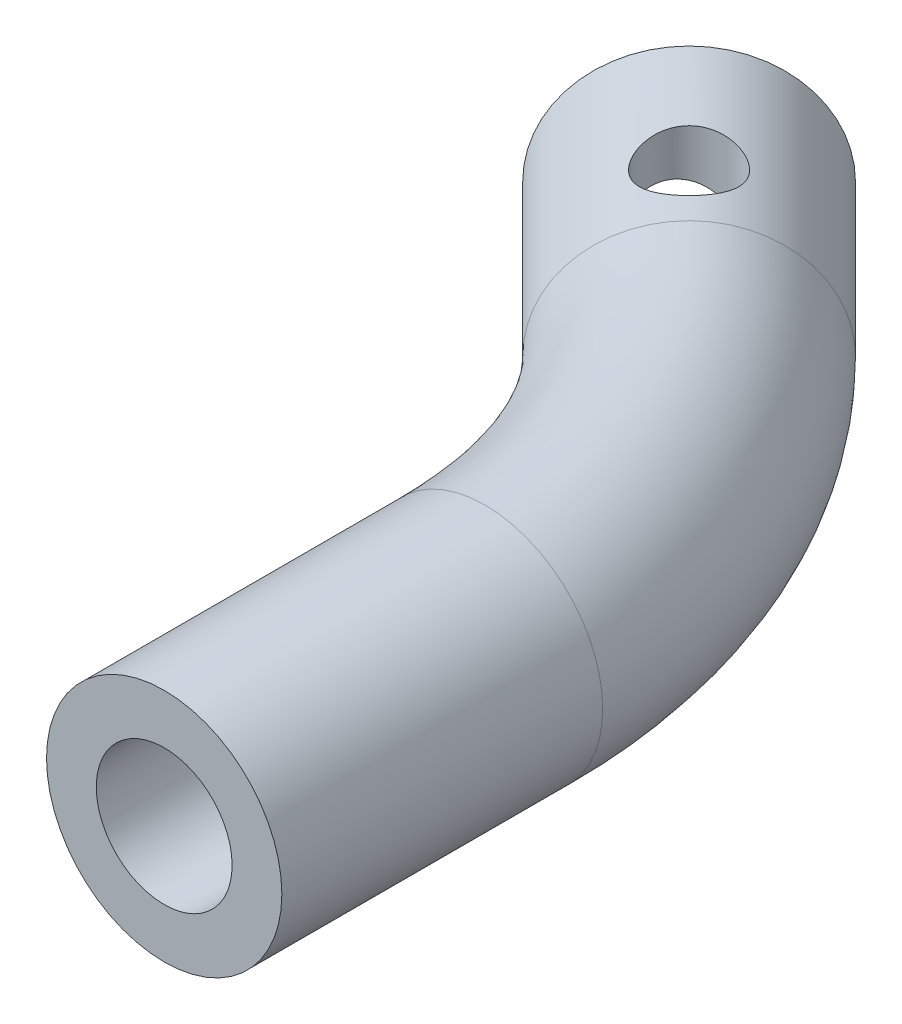
ISO-10303-21;
HEADER;
FILE_DESCRIPTION(('STEP AP214'),'2;1');
FILE_NAME('part.step','',(''),(''),'','','');
FILE_SCHEMA(('AUTOMOTIVE_DESIGN { 1 0 10303 214 1 1 1 1 }'));
ENDSEC;
DATA;
#1=APPLICATION_CONTEXT('core data for automotive mechanical design processes');
#2=APPLICATION_PROTOCOL_DEFINITION('international standard','automotive_design',2000,#1);
#3=PRODUCT_CONTEXT('',#1,'mechanical');
#4=PRODUCT('Part','Part','',(#3));
#5=PRODUCT_RELATED_PRODUCT_CATEGORY('part','',(#4));
#6=PRODUCT_DEFINITION_FORMATION('','',#4);
#7=PRODUCT_DEFINITION_CONTEXT('part definition',#1,'design');
#8=PRODUCT_DEFINITION('design','',#6,#7);
#9=PRODUCT_DEFINITION_SHAPE('','',#8);
#10=(LENGTH_UNIT() NAMED_UNIT(*) SI_UNIT(.MILLI.,.METRE.));
#11=(NAMED_UNIT(*) PLANE_ANGLE_UNIT() SI_UNIT($,.RADIAN.));
#12=(NAMED_UNIT(*) SI_UNIT($,.STERADIAN.) SOLID_ANGLE_UNIT());
#13=UNCERTAINTY_MEASURE_WITH_UNIT(LENGTH_MEASURE(1.E-05),#10,'distance_accuracy_value','');
#14=(GEOMETRIC_REPRESENTATION_CONTEXT(3) GLOBAL_UNCERTAINTY_ASSIGNED_CONTEXT((#13)) GLOBAL_UNIT_ASSIGNED_CONTEXT((#10,
#11,#12)) REPRESENTATION_CONTEXT('',''));
#15=CARTESIAN_POINT('',(0.,0.,0.));
#16=DIRECTION('',(0.,0.,1.));
#17=DIRECTION('',(1.,0.,0.));
#18=AXIS2_PLACEMENT_3D('',#15,#16,#17);
#19=CARTESIAN_POINT('',(-4.85514851334801,0.,-5.66753789451842));
#20=DIRECTION('',(-0.707106781186546,0.,-0.707106781186549));
#21=DIRECTION('',(-0.707106781186549,0.,0.707106781186546));
#22=AXIS2_PLACEMENT_3D('',#19,#20,#21);
#23=CYLINDRICAL_SURFACE('',#22,3.4);
#24=CARTESIAN_POINT('',(-11.9262163252135,0.,-12.7386057063839));
#25=DIRECTION('',(-0.707106781186546,0.,-0.707106781186549));
#26=DIRECTION('',(-0.707106781186549,0.,0.707106781186546));
#27=AXIS2_PLACEMENT_3D('',#24,#25,#26);
#28=CIRCLE('',#27,3.4);
#29=CARTESIAN_POINT('',(-14.3303793812477,0.,-10.3344426503497));
#30=VERTEX_POINT('',#29);
#31=EDGE_CURVE('E117',#30,#30,#28,.T.);
#32=ORIENTED_EDGE('',*,*,#31,.T.);
#33=EDGE_LOOP('',(#32));
#34=FACE_BOUND('',#33,.T.);
#35=DIRECTION('',(0.707106781186546,0.,0.707106781186549));
#36=VECTOR('',#35,1.);
#37=CARTESIAN_POINT('',(-4.99577531487929,3.14119041053837,-7.64823143654679));
#38=LINE('',#37,#36);
#39=CARTESIAN_POINT('',(-4.98523735315701,3.14119041053837,-7.63769347482451));
#40=VERTEX_POINT('',#39);
#41=CARTESIAN_POINT('',(-3.93511514309947,3.14119041053837,-6.58757126476696));
#42=VERTEX_POINT('',#41);
#43=EDGE_CURVE('E104',#40,#42,#38,.T.);
#44=ORIENTED_EDGE('',*,*,#43,.F.);
#45=CARTESIAN_POINT('',(-6.67356115657351,2.52253271517302,-10.7098701089745));
#46=CARTESIAN_POINT('',(-6.55526154963019,2.44691776482946,-10.709878421822));
#47=CARTESIAN_POINT('',(-6.43728565245653,2.37057966917331,-10.6994407447605));
#48=CARTESIAN_POINT('',(-6.26137811729352,2.25917821019611,-10.6678394111869));
#49=CARTESIAN_POINT('',(-6.20289948816892,2.2225506046758,-10.6546412790773));
#50=CARTESIAN_POINT('',(-6.08626923692473,2.15129800425115,-10.6226544093641));
#51=CARTESIAN_POINT('',(-6.02811742024183,2.11667167050862,-10.6038694622425));
#52=CARTESIAN_POINT('',(-5.90390378104353,2.04596608387551,-10.557203139409));
#53=CARTESIAN_POINT('',(-5.83789477035139,2.01038208762843,-10.5284073454198));
#54=CARTESIAN_POINT('',(-5.70680360416759,1.94622863375601,-10.4622246414599));
#55=CARTESIAN_POINT('',(-5.6417197958534,1.91764462865681,-10.424855866661));
#56=CARTESIAN_POINT('',(-5.52576134745873,1.8754986042017,-10.348893712856));
#57=CARTESIAN_POINT('',(-5.47453491323624,1.86011491507725,-10.3118797074926));
#58=CARTESIAN_POINT('',(-5.37475052743602,1.83830517020546,-10.2320901761024));
#59=CARTESIAN_POINT('',(-5.32618860246142,1.83186540791627,-10.1893235764904));
#60=CARTESIAN_POINT('',(-5.233166621319,1.82896003386553,-10.098927523642));
#61=CARTESIAN_POINT('',(-5.18872033187191,1.83252673084298,-10.0512827980984));
#62=CARTESIAN_POINT('',(-5.10538932951066,1.84909881521793,-9.9528555681239));
#63=CARTESIAN_POINT('',(-5.06651229267916,1.8621170826315,-9.90206886848894));
#64=CARTESIAN_POINT('',(-4.98293917862994,1.90135470035835,-9.78169552488008));
#65=CARTESIAN_POINT('',(-4.94059573583293,1.93052174184468,-9.71146474489963));
#66=CARTESIAN_POINT('',(-4.86606768396412,1.99763318404686,-9.56976709457376));
#67=CARTESIAN_POINT('',(-4.83391523316302,2.03560472786079,-9.49829704741538));
#68=CARTESIAN_POINT('',(-4.78412601513678,2.10891552726148,-9.36856963929637));
#69=CARTESIAN_POINT('',(-4.76488849994516,2.14336583734099,-9.31040364265767));
#70=CARTESIAN_POINT('',(-4.73203058098702,2.21435517669441,-9.19374197593372));
#71=CARTESIAN_POINT('',(-4.71841349566797,2.25089542546895,-9.13524613169725));
#72=CARTESIAN_POINT('',(-4.685565208046,2.36219050399284,-8.95919084490964));
#73=CARTESIAN_POINT('',(-4.67435248746648,2.43859464053477,-8.84110522568608));
#74=CARTESIAN_POINT('',(-4.67281810718242,2.59350069938162,-8.59892663826993));
#75=CARTESIAN_POINT('',(-4.68342595714279,2.67194939713078,-8.47479570651102));
#76=CARTESIAN_POINT('',(-4.7286003132437,2.82279933517461,-8.22729601308951));
#77=CARTESIAN_POINT('',(-4.76311864179805,2.8952124086235,-8.10392622120957));
#78=CARTESIAN_POINT('',(-4.84707626251959,3.01432591807542,-7.88884258974138));
#79=CARTESIAN_POINT('',(-4.89136250308966,3.06313471249311,-7.79628987564021));
#80=CARTESIAN_POINT('',(-4.99584958509249,3.15241208310844,-7.61620813950764));
#81=CARTESIAN_POINT('',(-5.05604116112898,3.19288549060535,-7.52867622870202));
#82=CARTESIAN_POINT('',(-5.19259437972342,3.26389260075955,-7.36136437650046));
#83=CARTESIAN_POINT('',(-5.26906827204316,3.29435336400565,-7.28164416657274));
#84=CARTESIAN_POINT('',(-5.43630803642037,3.3437323538685,-7.13456844564721));
#85=CARTESIAN_POINT('',(-5.52706507683809,3.36265767813901,-7.06720534930099));
#86=CARTESIAN_POINT('',(-5.70856362321691,3.38752886943995,-6.95521768576628));
#87=CARTESIAN_POINT('',(-5.79807188339817,3.39473131221924,-6.90885725840143));
#88=CARTESIAN_POINT('',(-5.98327676990398,3.40119546242199,-6.83007423780456));
#89=CARTESIAN_POINT('',(-6.07897353911308,3.40045698643496,-6.79765196651853));
#90=CARTESIAN_POINT('',(-6.27322389189978,3.39269343902147,-6.74779801907405));
#91=CARTESIAN_POINT('',(-6.37175430857739,3.3857101102259,-6.73026831097975));
#92=CARTESIAN_POINT('',(-6.56993383685082,3.36750538454942,-6.71007206006545));
#93=CARTESIAN_POINT('',(-6.66958333036493,3.35628249533798,-6.70741075615664));
#94=CARTESIAN_POINT('',(-6.87652232811577,3.33067693816152,-6.71727259768482));
#95=CARTESIAN_POINT('',(-6.98372545229111,3.31610471454564,-6.73113177639953));
#96=CARTESIAN_POINT('',(-7.19457387639125,3.2872374318287,-6.77591821952636));
#97=CARTESIAN_POINT('',(-7.29821784197097,3.27294247753264,-6.80685181258715));
#98=CARTESIAN_POINT('',(-7.50464426668039,3.24654497745026,-6.88718700831109));
#99=CARTESIAN_POINT('',(-7.60711374688189,3.23459125453998,-6.93744930312979));
#100=CARTESIAN_POINT('',(-7.80234862909014,3.21626606639913,-7.0549372012131));
#101=CARTESIAN_POINT('',(-7.89511896679481,3.20989174962622,-7.12215411659592));
#102=CARTESIAN_POINT('',(-8.06418119376158,3.20418594255973,-7.26830376511213));
#103=CARTESIAN_POINT('',(-8.1410148074268,3.20455979857615,-7.34659871439432));
#104=CARTESIAN_POINT('',(-8.28074861315569,3.21155389818353,-7.51451256201124));
#105=CARTESIAN_POINT('',(-8.34364853277737,3.21817426389762,-7.6041316817108));
#106=CARTESIAN_POINT('',(-8.45253119354884,3.23616335830246,-7.7897731119036));
#107=CARTESIAN_POINT('',(-8.49887886508365,3.24741607786346,-7.88559384533096));
#108=CARTESIAN_POINT('',(-8.57575370310433,3.27266575094598,-8.08305460996796));
#109=CARTESIAN_POINT('',(-8.60627520297237,3.2866636849324,-8.18469671109436));
#110=CARTESIAN_POINT('',(-8.65206867969975,3.31573328954871,-8.39696418026023));
#111=CARTESIAN_POINT('',(-8.66644911529756,3.33082260144181,-8.50778038138248));
#112=CARTESIAN_POINT('',(-8.67656090833608,3.3583194135932,-8.73062753198165));
#113=CARTESIAN_POINT('',(-8.67229033312946,3.37072663578931,-8.84265860614576));
#114=CARTESIAN_POINT('',(-8.64488118854604,3.38988012575587,-9.06566083328911));
#115=CARTESIAN_POINT('',(-8.62162502135966,3.39659057746631,-9.17662100650523));
#116=CARTESIAN_POINT('',(-8.55660749684578,3.40140927452412,-9.39316035792195));
#117=CARTESIAN_POINT('',(-8.51486187252923,3.3995248207822,-9.49874402610273));
#118=CARTESIAN_POINT('',(-8.41877627601934,3.38575829448733,-9.69215252969889));
#119=CARTESIAN_POINT('',(-8.36581208056794,3.37474154399631,-9.78072398505206));
#120=CARTESIAN_POINT('',(-8.24790117007648,3.34316415190473,-9.94756202031571));
#121=CARTESIAN_POINT('',(-8.18295740850578,3.32260586080727,-10.0258311320568));
#122=CARTESIAN_POINT('',(-8.0470488589896,3.2733949613266,-10.166813728161));
#123=CARTESIAN_POINT('',(-7.97649998920151,3.24515946590663,-10.2300782175125));
#124=CARTESIAN_POINT('',(-7.82942752278879,3.18114582769358,-10.3447019371026));
#125=CARTESIAN_POINT('',(-7.75290140269784,3.14536448825207,-10.396056102345));
#126=CARTESIAN_POINT('',(-7.5893166398891,3.06415400080565,-10.4906214954634));
#127=CARTESIAN_POINT('',(-7.50191839635204,3.01815950337371,-10.5327512694249));
#128=CARTESIAN_POINT('',(-7.32486023073054,2.92052549705724,-10.6032528245899));
#129=CARTESIAN_POINT('',(-7.23520051361889,2.86888649836815,-10.631625847981));
#130=CARTESIAN_POINT('',(-7.06679710090465,2.76869059798469,-10.6724878540904));
#131=CARTESIAN_POINT('',(-6.98814799465012,2.72060440631464,-10.6865611741937));
#132=CARTESIAN_POINT('',(-6.83080539202486,2.62263030600994,-10.7052534957285));
#133=CARTESIAN_POINT('',(-6.7521119134588,2.57274092579012,-10.7098645892566));
#134=CARTESIAN_POINT('',(-6.67356115657351,2.52253271517302,-10.7098701089745));
#135=B_SPLINE_CURVE_WITH_KNOTS('',3,(#45,#46,#47,#48,#49,#50,#51,#52,#53,#54,#55,#56,#57,#58,
#59,#60,#61,#62,#63,#64,#65,#66,#67,#68,#69,#70,#71,#72,#73,#74,#75,#76,#77,#78,#79,#80,#81,#82,
#83,#84,#85,#86,#87,#88,#89,#90,#91,#92,#93,#94,#95,#96,#97,#98,#99,#100,#101,#102,#103,#104,
#105,#106,#107,#108,#109,#110,#111,#112,#113,#114,#115,#116,#117,#118,#119,#120,#121,#122,#123,
#124,#125,#126,#127,#128,#129,#130,#131,#132,#133,#134),.UNSPECIFIED.,.T.,.F.,(4,2,2,2,2,2,2,2,
2,2,2,2,2,2,2,2,2,2,2,2,2,2,2,2,2,2,2,2,2,2,2,2,2,2,2,2,2,2,2,2,2,2,2,2,4),(0.,
0.420877556060488,0.631453268539794,0.841886436540249,1.08228548398687,1.32218060849014,
1.51653166005792,1.71058453932434,1.90526469467741,2.10021064726996,2.35987254589386,
2.62034584822034,2.8309269953559,3.04163229781573,3.46319402526611,3.90308465074082,
4.34209150237596,4.68162616237093,5.0209634663061,5.36272062508885,5.7042672908779,
6.00597081682463,6.30768131119849,6.60739002544189,6.90720433597778,7.23300367096236,
7.5589238449631,7.90145066598973,8.24380232482465,8.57124308386016,8.89869024469645,
9.21839279977457,9.53820974659755,9.87493514117825,10.2116954286063,10.5505575980271,
10.8891319758633,11.1988648823736,11.5085215284476,11.8038945025891,12.0993928579484,
12.4203274942163,12.7412331457804,13.0204619289775,13.2999239782506),.UNSPECIFIED.);
#136=CARTESIAN_POINT('',(-5.65582664434439,3.38006193389118,-6.98818010708169));
#137=VERTEX_POINT('',#136);
#138=EDGE_CURVE('E103',#137,#40,#135,.T.);
#139=ORIENTED_EDGE('',*,*,#138,.F.);
#140=CARTESIAN_POINT('',(-5.91580868512783,0.,-6.72819806629825));
#141=DIRECTION('',(-0.707106781186546,0.,-0.707106781186549));
#142=DIRECTION('',(-0.707106781186549,0.,0.707106781186546));
#143=AXIS2_PLACEMENT_3D('',#140,#141,#142);
#144=CIRCLE('',#143,3.4);
#145=CARTESIAN_POINT('',(-5.68174798749104,3.38384857516461,-6.96225876393503));
#146=VERTEX_POINT('',#145);
#147=EDGE_CURVE('E56',#146,#137,#144,.T.);
#148=ORIENTED_EDGE('',*,*,#147,.F.);
#149=DIRECTION('',(0.707106781186546,0.,0.707106781186549));
#150=VECTOR('',#149,1.);
#151=CARTESIAN_POINT('',(-5.68174798749104,3.38384857516461,-6.96225876393503));
#152=LINE('',#151,#150);
#153=CARTESIAN_POINT('',(-4.62108781571122,3.38384857516461,-5.90159859215521));
#154=VERTEX_POINT('',#153);
#155=EDGE_CURVE('E198',#146,#154,#152,.T.);
#156=ORIENTED_EDGE('',*,*,#155,.T.);
#157=CARTESIAN_POINT('',(-4.85514851334801,0.,-5.66753789451842));
#158=DIRECTION('',(-0.707106781186546,0.,-0.707106781186549));
#159=DIRECTION('',(-0.707106781186549,0.,0.707106781186546));
#160=AXIS2_PLACEMENT_3D('',#157,#158,#159);
#161=CIRCLE('',#160,3.4);
#162=CARTESIAN_POINT('',(-5.77518188359656,-3.14119041053837,-4.74750452426988));
#163=VERTEX_POINT('',#162);
#164=EDGE_CURVE('E118',#163,#154,#161,.T.);
#165=ORIENTED_EDGE('',*,*,#164,.F.);
#166=DIRECTION('',(0.707106781186546,0.,0.707106781186549));
#167=VECTOR('',#166,1.);
#168=CARTESIAN_POINT('',(-6.83584205537638,-3.14119041053837,-5.8081646960497));
#169=LINE('',#168,#167);
#170=CARTESIAN_POINT('',(-6.83584205537638,-3.14119041053837,-5.8081646960497));
#171=VERTEX_POINT('',#170);
#172=EDGE_CURVE('E197',#171,#163,#169,.T.);
#173=ORIENTED_EDGE('',*,*,#172,.F.);
#174=CARTESIAN_POINT('',(-5.91580868512783,0.,-6.72819806629825));
#175=DIRECTION('',(-0.707106781186546,0.,-0.707106781186549));
#176=DIRECTION('',(-0.707106781186549,0.,0.707106781186546));
#177=AXIS2_PLACEMENT_3D('',#174,#175,#176);
#178=CIRCLE('',#177,3.4);
#179=CARTESIAN_POINT('',(-6.14986938276463,-3.38384857516461,-6.49413736866145));
#180=VERTEX_POINT('',#179);
#181=EDGE_CURVE('E100',#180,#171,#178,.T.);
#182=ORIENTED_EDGE('',*,*,#181,.F.);
#183=DIRECTION('',(0.707106781186546,0.,0.707106781186549));
#184=VECTOR('',#183,1.);
#185=CARTESIAN_POINT('',(-6.14986938276463,-3.38384857516461,-6.49413736866145));
#186=LINE('',#185,#184);
#187=CARTESIAN_POINT('',(-5.08920921098481,-3.38384857516461,-5.43347719688163));
#188=VERTEX_POINT('',#187);
#189=EDGE_CURVE('E98',#180,#188,#186,.T.);
#190=ORIENTED_EDGE('',*,*,#189,.T.);
#191=EDGE_CURVE('E184',#42,#188,#161,.T.);
#192=ORIENTED_EDGE('',*,*,#191,.F.);
#193=EDGE_LOOP('',(#44,#139,#148,#156,#165,#173,#182,#190,#192));
#194=FACE_BOUND('',#193,.T.);
#195=ADVANCED_FACE('F35',(#34,#194),#23,.F.);
#196=CARTESIAN_POINT('',(-4.85514851334801,0.,-5.66753789451842));
#197=DIRECTION('',(-0.707106781186546,0.,-0.707106781186549));
#198=DIRECTION('',(-0.707106781186549,0.,0.707106781186546));
#199=AXIS2_PLACEMENT_3D('',#196,#197,#198);
#200=PLANE('',#199);
#201=ORIENTED_EDGE('',*,*,#191,.T.);
#202=DIRECTION('',(-0.171585233717496,-0.970111857024861,0.171585233717496));
#203=VECTOR('',#202,1.);
#204=CARTESIAN_POINT('',(-3.93511514309947,3.14119041053837,-6.58757126476696));
#205=LINE('',#204,#203);
#206=EDGE_CURVE('E194',#42,#188,#205,.T.);
#207=ORIENTED_EDGE('',*,*,#206,.F.);
#208=EDGE_LOOP('',(#201,#207));
#209=FACE_BOUND('',#208,.T.);
#210=ADVANCED_FACE('F131',(#209),#200,.T.);
#211=ORIENTED_EDGE('',*,*,#164,.T.);
#212=DIRECTION('',(0.171585233717496,0.970111857024861,-0.171585233717496));
#213=VECTOR('',#212,1.);
#214=CARTESIAN_POINT('',(-4.62108781571122,3.38384857516461,-5.90159859215521));
#215=LINE('',#214,#213);
#216=EDGE_CURVE('E91',#163,#154,#215,.T.);
#217=ORIENTED_EDGE('',*,*,#216,.F.);
#218=EDGE_LOOP('',(#211,#217));
#219=FACE_BOUND('',#218,.T.);
#220=ADVANCED_FACE('F134',(#219),#200,.T.);
#221=CARTESIAN_POINT('',(-4.24318872773271,0.,-6.27949768013372));
#222=DIRECTION('',(-0.707106781186546,0.,-0.707106781186549));
#223=DIRECTION('',(-0.707106781186549,0.,0.707106781186546));
#224=AXIS2_PLACEMENT_3D('',#221,#222,#223);
#225=CYLINDRICAL_SURFACE('',#224,5.5);
#226=CARTESIAN_POINT('',(-11.3142565395982,0.,-13.3505654919992));
#227=DIRECTION('',(0.707106781186546,0.,0.707106781186549));
#228=DIRECTION('',(0.707106781186549,0.,-0.707106781186546));
#229=AXIS2_PLACEMENT_3D('',#226,#227,#228);
#230=CIRCLE('',#229,5.5);
#231=CARTESIAN_POINT('',(-7.42516924307215,0.,-17.2396527885252));
#232=VERTEX_POINT('',#231);
#233=EDGE_CURVE('E11',#232,#232,#230,.T.);
#234=ORIENTED_EDGE('',*,*,#233,.T.);
#235=EDGE_LOOP('',(#234));
#236=FACE_BOUND('',#235,.T.);
#237=CARTESIAN_POINT('',(-4.24318872773271,0.,-6.27949768013372));
#238=DIRECTION('',(0.707106781186546,0.,0.707106781186549));
#239=DIRECTION('',(0.707106781186549,0.,-0.707106781186546));
#240=AXIS2_PLACEMENT_3D('',#237,#238,#239);
#241=CIRCLE('',#240,5.5);
#242=CARTESIAN_POINT('',(-0.354101431206687,0.,-10.1685849766597));
#243=VERTEX_POINT('',#242);
#244=EDGE_CURVE('E49',#243,#243,#241,.T.);
#245=ORIENTED_EDGE('',*,*,#244,.F.);
#246=EDGE_LOOP('',(#245));
#247=FACE_BOUND('',#246,.T.);
#248=CARTESIAN_POINT('',(-8.0877747189466,5.5,-10.1240836713476));
#249=CARTESIAN_POINT('',(-8.16452831758185,5.50000205657184,-10.0473340507905));
#250=CARTESIAN_POINT('',(-8.234996006339,5.49675838182447,-9.9643265195262));
#251=CARTESIAN_POINT('',(-8.36136729962181,5.4841414750815,-9.78831596191188));
#252=CARTESIAN_POINT('',(-8.41727202275813,5.47476871406757,-9.6953137040525));
#253=CARTESIAN_POINT('',(-8.51305225101103,5.45090325673945,-9.50225207482754));
#254=CARTESIAN_POINT('',(-8.55295725100334,5.43642007485985,-9.4022060924644));
#255=CARTESIAN_POINT('',(-8.61614277072326,5.4037862710006,-9.19757073452031));
#256=CARTESIAN_POINT('',(-8.63941912305876,5.38563473113581,-9.09298022697422));
#257=CARTESIAN_POINT('',(-8.66954892095764,5.34673088503245,-8.87793458892994));
#258=CARTESIAN_POINT('',(-8.67577507637168,5.32590805596802,-8.76740443518114));
#259=CARTESIAN_POINT('',(-8.66995428837057,5.28436672781322,-8.54678177030308));
#260=CARTESIAN_POINT('',(-8.65790223441597,5.26364825952702,-8.43668939020395));
#261=CARTESIAN_POINT('',(-8.61493368558053,5.22385385598189,-8.21572588793645));
#262=CARTESIAN_POINT('',(-8.58336502149342,5.20486193866807,-8.10496495576423));
#263=CARTESIAN_POINT('',(-8.50136000332874,5.17176122573932,-7.88988018575215));
#264=CARTESIAN_POINT('',(-8.45093068704065,5.15765061245797,-7.78555396371607));
#265=CARTESIAN_POINT('',(-8.33473042351508,5.13666087499577,-7.59054452596512));
#266=CARTESIAN_POINT('',(-8.2696349706428,5.12952103621697,-7.49948777964852));
#267=CARTESIAN_POINT('',(-8.1250027778227,5.12251577517209,-7.32937427068885));
#268=CARTESIAN_POINT('',(-8.04547156555381,5.12264757431404,-7.25031293601531));
#269=CARTESIAN_POINT('',(-7.87933058242696,5.1299448506341,-7.11073406589202));
#270=CARTESIAN_POINT('',(-7.79336242218367,5.13671788212537,-7.04942856751557));
#271=CARTESIAN_POINT('',(-7.61333856657803,5.15588510806292,-6.94129784467086));
#272=CARTESIAN_POINT('',(-7.51928172802253,5.16828009813625,-6.89447467133854));
#273=CARTESIAN_POINT('',(-7.32383361001914,5.19754287313288,-6.81554741306674));
#274=CARTESIAN_POINT('',(-7.22234005787155,5.21448789682278,-6.78372647867357));
#275=CARTESIAN_POINT('',(-7.01602832487367,5.25091385937533,-6.73656756724884));
#276=CARTESIAN_POINT('',(-6.9112090557319,5.27039563496266,-6.72123504428884));
#277=CARTESIAN_POINT('',(-6.69393081692634,5.31119569956226,-6.70683001353953));
#278=CARTESIAN_POINT('',(-6.58140599054632,5.33255243042911,-6.70884083207248));
#279=CARTESIAN_POINT('',(-6.35796657870817,5.37363749840679,-6.73173613883623));
#280=CARTESIAN_POINT('',(-6.24705221397078,5.39336561401291,-6.75262318978537));
#281=CARTESIAN_POINT('',(-6.02823027848331,5.42932219694274,-6.81339653784776));
#282=CARTESIAN_POINT('',(-5.92038510816422,5.44549875602856,-6.8535403910232));
#283=CARTESIAN_POINT('',(-5.71262621743094,5.47214720693441,-6.95208533878169));
#284=CARTESIAN_POINT('',(-5.61270920837776,5.48262147477141,-7.01047881316705));
#285=CARTESIAN_POINT('',(-5.42888786778987,5.49627428963535,-7.1405327475773));
#286=CARTESIAN_POINT('',(-5.34443002279792,5.49979422865534,-7.21137532020162));
#287=CARTESIAN_POINT('',(-5.18829986038231,5.50018795318754,-7.36597237515091));
#288=CARTESIAN_POINT('',(-5.11662491011348,5.49706310901842,-7.44972419196665));
#289=CARTESIAN_POINT('',(-4.99046822234876,5.48474392235954,-7.62433368526979));
#290=CARTESIAN_POINT('',(-4.93546432641416,5.47577009231647,-7.71483125614979));
#291=CARTESIAN_POINT('',(-4.84058459426364,5.45287588831336,-7.90284491553533));
#292=CARTESIAN_POINT('',(-4.80071072699976,5.43895487100538,-8.00036191555379));
#293=CARTESIAN_POINT('',(-4.73592225071167,5.40705571750079,-8.20275174584419));
#294=CARTESIAN_POINT('',(-4.71146918019055,5.38897272874453,-8.30775529970009));
#295=CARTESIAN_POINT('',(-4.67970559457663,5.35076522574994,-8.51997218250774));
#296=CARTESIAN_POINT('',(-4.67240113991934,5.3306399923892,-8.62718627918069));
#297=CARTESIAN_POINT('',(-4.67509088504954,5.28921180356835,-8.84724634652312));
#298=CARTESIAN_POINT('',(-4.6860491537308,5.26790441656513,-8.96008093672248));
#299=CARTESIAN_POINT('',(-4.72696469383536,5.22759328693504,-9.18270186703982));
#300=CARTESIAN_POINT('',(-4.75692315411455,5.20858968854653,-9.2924880159659));
#301=CARTESIAN_POINT('',(-4.83542371125389,5.17515419274761,-9.50625958586144));
#302=CARTESIAN_POINT('',(-4.88400483595611,5.16073201356675,-9.61023229557003));
#303=CARTESIAN_POINT('',(-4.99862169772614,5.13846087649099,-9.80882505891195));
#304=CARTESIAN_POINT('',(-5.06464747688998,5.13060817917034,-9.90345040608213));
#305=CARTESIAN_POINT('',(-5.20768941161632,5.12284228170686,-10.0747547134592));
#306=CARTESIAN_POINT('',(-5.2837955833736,5.12247623555331,-10.152174236079));
#307=CARTESIAN_POINT('',(-5.44735826555429,5.12857566975999,-10.2935714337226));
#308=CARTESIAN_POINT('',(-5.53481382639516,5.13504057890957,-10.3575502321357));
#309=CARTESIAN_POINT('',(-5.71590289360548,5.15370717596286,-10.4688146427149));
#310=CARTESIAN_POINT('',(-5.8093062027218,5.16574946028865,-10.5165038900797));
#311=CARTESIAN_POINT('',(-6.0018369762473,5.19413013423955,-10.5965773766476));
#312=CARTESIAN_POINT('',(-6.10096583952856,5.21046957724445,-10.6289578576987));
#313=CARTESIAN_POINT('',(-6.30765459263878,5.24662240525316,-10.6791292136635));
#314=CARTESIAN_POINT('',(-6.41538807882178,5.26656880255672,-10.6961080684321));
#315=CARTESIAN_POINT('',(-6.63205994717182,5.30720401505186,-10.7123907691469));
#316=CARTESIAN_POINT('',(-6.74099869072411,5.32789305733489,-10.7116891618542));
#317=CARTESIAN_POINT('',(-6.96297696914748,5.36891606148755,-10.6921047868592));
#318=CARTESIAN_POINT('',(-7.07595161648298,5.38918141250994,-10.6723212038257));
#319=CARTESIAN_POINT('',(-7.2974423377293,5.42597802894301,-10.6135238392683));
#320=CARTESIAN_POINT('',(-7.40595850880166,5.44250937576248,-10.5745104770513));
#321=CARTESIAN_POINT('',(-7.61718585844028,5.47019903727863,-10.4771650572577));
#322=CARTESIAN_POINT('',(-7.71975572212556,5.48125425902285,-10.4184948377712));
#323=CARTESIAN_POINT('',(-7.91328649156054,5.49615207881264,-10.283709427209));
#324=CARTESIAN_POINT('',(-8.00425234751729,5.49999776206249,-10.2076017138787));
#325=CARTESIAN_POINT('',(-8.0877747189466,5.5,-10.1240836713476));
#326=B_SPLINE_CURVE_WITH_KNOTS('',3,(#248,#249,#250,#251,#252,#253,#254,#255,#256,#257,#258,
#259,#260,#261,#262,#263,#264,#265,#266,#267,#268,#269,#270,#271,#272,#273,#274,#275,#276,#277,
#278,#279,#280,#281,#282,#283,#284,#285,#286,#287,#288,#289,#290,#291,#292,#293,#294,#295,#296,
#297,#298,#299,#300,#301,#302,#303,#304,#305,#306,#307,#308,#309,#310,#311,#312,#313,#314,#315,
#316,#317,#318,#319,#320,#321,#322,#323,#324,#325),.UNSPECIFIED.,.T.,.F.,(4,2,2,2,2,2,2,2,2,2,2,
2,2,2,2,2,2,2,2,2,2,2,2,2,2,2,2,2,2,2,2,2,2,2,2,2,2,2,4),(0.,0.325194104136431,0.65036322209004,
0.974930116318941,1.2995783234422,1.63601964163853,1.97255504528971,2.32099392094054,
2.66930290729857,3.00401939097088,3.33860797579857,3.65454759073094,3.97053193181531,
4.29226244373356,4.61409934564612,4.95617818949658,5.29830348241717,5.64513792605579,
5.99182774072784,6.32102805388949,6.65016048438683,6.96755079702181,7.2849823992121,
7.61151258405806,7.93815814949471,8.28259860829996,8.62706062112335,8.97224851093866,
9.31723978183251,9.64129740492555,9.96532793217199,10.2806204101951,10.5959902492892,
10.9271566786297,11.2584252518918,11.6061385710831,11.9538443086926,12.3078682758854,
12.6617407096898),.UNSPECIFIED.);
#327=CARTESIAN_POINT('',(-8.0877747189466,5.5,-10.1240836713476));
#328=VERTEX_POINT('',#327);
#329=EDGE_CURVE('E110',#328,#328,#326,.T.);
#330=ORIENTED_EDGE('',*,*,#329,.F.);
#331=EDGE_LOOP('',(#330));
#332=FACE_BOUND('',#331,.T.);
#333=ADVANCED_FACE('F120',(#236,#247,#332),#225,.T.);
#334=CARTESIAN_POINT('',(2.5,0.,25.));
#335=DIRECTION('',(0.,0.,1.));
#336=DIRECTION('',(1.,0.,0.));
#337=AXIS2_PLACEMENT_3D('',#334,#335,#336);
#338=PLANE('',#337);
#339=CARTESIAN_POINT('',(2.5,0.,25.));
#340=DIRECTION('',(0.,0.,1.));
#341=DIRECTION('',(1.,0.,0.));
#342=AXIS2_PLACEMENT_3D('',#339,#340,#341);
#343=CIRCLE('',#342,3.175);
#344=CARTESIAN_POINT('',(5.675,0.,25.));
#345=VERTEX_POINT('',#344);
#346=EDGE_CURVE('E181',#345,#345,#343,.T.);
#347=ORIENTED_EDGE('',*,*,#346,.F.);
#348=EDGE_LOOP('',(#347));
#349=FACE_BOUND('',#348,.T.);
#350=CARTESIAN_POINT('',(2.5,0.,25.));
#351=DIRECTION('',(0.,0.,1.));
#352=DIRECTION('',(1.,0.,0.));
#353=AXIS2_PLACEMENT_3D('',#350,#351,#352);
#354=CIRCLE('',#353,5.5);
#355=CARTESIAN_POINT('',(8.,0.,25.));
#356=VERTEX_POINT('',#355);
#357=EDGE_CURVE('E175',#356,#356,#354,.T.);
#358=ORIENTED_EDGE('',*,*,#357,.T.);
#359=EDGE_LOOP('',(#358));
#360=FACE_BOUND('',#359,.T.);
#361=ADVANCED_FACE('F37',(#349,#360),#338,.T.);
#362=CARTESIAN_POINT('',(-11.3142565395982,0.,-13.3505654919992));
#363=DIRECTION('',(0.707106781186546,0.,0.707106781186549));
#364=DIRECTION('',(0.707106781186549,0.,-0.707106781186546));
#365=AXIS2_PLACEMENT_3D('',#362,#363,#364);
#366=PLANE('',#365);
#367=ORIENTED_EDGE('',*,*,#31,.F.);
#368=EDGE_LOOP('',(#367));
#369=FACE_BOUND('',#368,.T.);
#370=ORIENTED_EDGE('',*,*,#233,.F.);
#371=EDGE_LOOP('',(#370));
#372=FACE_BOUND('',#371,.T.);
#373=ADVANCED_FACE('F150',(#369,#372),#366,.F.);
#374=CARTESIAN_POINT('',(2.5,0.,25.));
#375=DIRECTION('',(0.,0.,-1.));
#376=DIRECTION('',(-1.,0.,0.));
#377=AXIS2_PLACEMENT_3D('',#374,#375,#376);
#378=CYLINDRICAL_SURFACE('',#377,5.5);
#379=CARTESIAN_POINT('',(2.5,0.,10.));
#380=DIRECTION('',(0.,0.,1.));
#381=DIRECTION('',(1.,0.,0.));
#382=AXIS2_PLACEMENT_3D('',#379,#380,#381);
#383=CIRCLE('',#382,5.5);
#384=CARTESIAN_POINT('',(8.,0.,10.));
#385=VERTEX_POINT('',#384);
#386=EDGE_CURVE('E172',#385,#385,#383,.T.);
#387=ORIENTED_EDGE('',*,*,#386,.T.);
#388=EDGE_LOOP('',(#387));
#389=FACE_BOUND('',#388,.T.);
#390=ORIENTED_EDGE('',*,*,#357,.F.);
#391=EDGE_LOOP('',(#390));
#392=FACE_BOUND('',#391,.T.);
#393=ADVANCED_FACE('F148',(#389,#392),#378,.T.);
#394=CARTESIAN_POINT('',(-20.5226864078665,0.,10.));
#395=DIRECTION('',(0.,1.,0.));
#396=DIRECTION('',(0.,0.,1.));
#397=AXIS2_PLACEMENT_3D('',#394,#395,#396);
#398=TOROIDAL_SURFACE('',#397,23.0226864078665,5.5);
#399=CARTESIAN_POINT('',(-20.5226864078665,0.,10.));
#400=DIRECTION('',(0.,1.,0.));
#401=DIRECTION('',(0.,0.,1.));
#402=AXIS2_PLACEMENT_3D('',#399,#400,#401);
#403=CIRCLE('',#402,28.5226864078665);
#404=EDGE_CURVE('',#385,#243,#403,.T.);
#405=ORIENTED_EDGE('',*,*,#386,.F.);
#406=ORIENTED_EDGE('',*,*,#244,.T.);
#407=ORIENTED_EDGE('',*,*,#404,.T.);
#408=ORIENTED_EDGE('',*,*,#404,.F.);
#409=EDGE_LOOP('',(#405,#407,#406,#408));
#410=FACE_BOUND('',#409,.T.);
#411=ADVANCED_FACE('F146',(#410),#398,.T.);
#412=CARTESIAN_POINT('',(2.5,0.,15.));
#413=DIRECTION('',(0.,0.,1.));
#414=DIRECTION('',(1.,0.,0.));
#415=AXIS2_PLACEMENT_3D('',#412,#413,#414);
#416=CYLINDRICAL_SURFACE('',#415,3.175);
#417=CARTESIAN_POINT('',(2.5,0.,15.));
#418=DIRECTION('',(0.,0.,1.));
#419=DIRECTION('',(1.,0.,0.));
#420=AXIS2_PLACEMENT_3D('',#417,#418,#419);
#421=CIRCLE('',#420,3.175);
#422=CARTESIAN_POINT('',(5.675,0.,15.));
#423=VERTEX_POINT('',#422);
#424=EDGE_CURVE('E180',#423,#423,#421,.T.);
#425=ORIENTED_EDGE('',*,*,#424,.F.);
#426=EDGE_LOOP('',(#425));
#427=FACE_BOUND('',#426,.T.);
#428=ORIENTED_EDGE('',*,*,#346,.T.);
#429=EDGE_LOOP('',(#428));
#430=FACE_BOUND('',#429,.T.);
#431=ADVANCED_FACE('F142',(#427,#430),#416,.F.);
#432=CARTESIAN_POINT('',(2.5,0.,15.));
#433=DIRECTION('',(0.,0.,1.));
#434=DIRECTION('',(1.,0.,0.));
#435=AXIS2_PLACEMENT_3D('',#432,#433,#434);
#436=PLANE('',#435);
#437=ORIENTED_EDGE('',*,*,#424,.T.);
#438=EDGE_LOOP('',(#437));
#439=FACE_BOUND('',#438,.T.);
#440=ADVANCED_FACE('F128',(#439),#436,.T.);
#441=CARTESIAN_POINT('',(-6.67356115657351,5.5,-8.70987010897453));
#442=DIRECTION('',(0.,-1.,0.));
#443=DIRECTION('',(0.,0.,-1.));
#444=AXIS2_PLACEMENT_3D('',#441,#442,#443);
#445=CYLINDRICAL_SURFACE('',#444,2.);
#446=EDGE_CURVE('E39',#40,#137,#135,.T.);
#447=ORIENTED_EDGE('',*,*,#446,.T.);
#448=ORIENTED_EDGE('',*,*,#138,.T.);
#449=EDGE_LOOP('',(#447,#448));
#450=FACE_BOUND('',#449,.T.);
#451=ORIENTED_EDGE('',*,*,#329,.T.);
#452=EDGE_LOOP('',(#451));
#453=FACE_BOUND('',#452,.T.);
#454=ADVANCED_FACE('F123',(#450,#453),#445,.F.);
#455=CARTESIAN_POINT('',(-5.91580868512783,0.,-6.72819806629825));
#456=DIRECTION('',(0.707106781186546,0.,0.707106781186549));
#457=DIRECTION('',(0.707106781186549,0.,-0.707106781186546));
#458=AXIS2_PLACEMENT_3D('',#455,#456,#457);
#459=CYLINDRICAL_SURFACE('',#458,3.4);
#460=ORIENTED_EDGE('',*,*,#446,.F.);
#461=CARTESIAN_POINT('',(-4.99577531487929,3.14119041053837,-7.64823143654679));
#462=VERTEX_POINT('',#461);
#463=EDGE_CURVE('E95',#462,#40,#38,.T.);
#464=ORIENTED_EDGE('',*,*,#463,.F.);
#465=EDGE_CURVE('E85',#137,#462,#144,.T.);
#466=ORIENTED_EDGE('',*,*,#465,.F.);
#467=EDGE_LOOP('',(#460,#464,#466));
#468=FACE_BOUND('',#467,.T.);
#469=ADVANCED_FACE('F102',(#468),#459,.T.);
#470=CARTESIAN_POINT('',(-4.99577531487929,3.14119041053837,-7.64823143654679));
#471=DIRECTION('',(-0.685972672611755,0.24265816462624,0.685972672611752));
#472=DIRECTION('',(0.707106781186546,0.,0.707106781186549));
#473=AXIS2_PLACEMENT_3D('',#470,#471,#472);
#474=PLANE('',#473);
#475=ORIENTED_EDGE('',*,*,#206,.T.);
#476=ORIENTED_EDGE('',*,*,#189,.F.);
#477=DIRECTION('',(-0.171585233717496,-0.970111857024861,0.171585233717496));
#478=VECTOR('',#477,1.);
#479=CARTESIAN_POINT('',(-4.99577531487929,3.14119041053837,-7.64823143654679));
#480=LINE('',#479,#478);
#481=EDGE_CURVE('E88',#462,#180,#480,.T.);
#482=ORIENTED_EDGE('',*,*,#481,.F.);
#483=ORIENTED_EDGE('',*,*,#463,.T.);
#484=ORIENTED_EDGE('',*,*,#43,.T.);
#485=EDGE_LOOP('',(#475,#476,#482,#483,#484));
#486=FACE_BOUND('',#485,.T.);
#487=ADVANCED_FACE('F94',(#486),#474,.F.);
#488=CARTESIAN_POINT('',(-5.68174798749104,3.38384857516461,-6.96225876393503));
#489=DIRECTION('',(0.685972672611755,-0.24265816462624,-0.685972672611752));
#490=DIRECTION('',(-0.707106781186546,0.,-0.707106781186549));
#491=AXIS2_PLACEMENT_3D('',#488,#489,#490);
#492=PLANE('',#491);
#493=ORIENTED_EDGE('',*,*,#216,.T.);
#494=ORIENTED_EDGE('',*,*,#155,.F.);
#495=DIRECTION('',(0.171585233717496,0.970111857024861,-0.171585233717496));
#496=VECTOR('',#495,1.);
#497=CARTESIAN_POINT('',(-5.68174798749104,3.38384857516461,-6.96225876393503));
#498=LINE('',#497,#496);
#499=EDGE_CURVE('E202',#171,#146,#498,.T.);
#500=ORIENTED_EDGE('',*,*,#499,.F.);
#501=ORIENTED_EDGE('',*,*,#172,.T.);
#502=EDGE_LOOP('',(#493,#494,#500,#501));
#503=FACE_BOUND('',#502,.T.);
#504=ADVANCED_FACE('F209',(#503),#492,.F.);
#505=CARTESIAN_POINT('',(-5.91580868512783,0.,-6.72819806629825));
#506=DIRECTION('',(-0.707106781186546,0.,-0.707106781186549));
#507=DIRECTION('',(-0.707106781186549,0.,0.707106781186546));
#508=AXIS2_PLACEMENT_3D('',#505,#506,#507);
#509=PLANE('',#508);
#510=ORIENTED_EDGE('',*,*,#147,.T.);
#511=ORIENTED_EDGE('',*,*,#465,.T.);
#512=ORIENTED_EDGE('',*,*,#481,.T.);
#513=ORIENTED_EDGE('',*,*,#181,.T.);
#514=ORIENTED_EDGE('',*,*,#499,.T.);
#515=EDGE_LOOP('',(#510,#511,#512,#513,#514));
#516=FACE_BOUND('',#515,.T.);
#517=ADVANCED_FACE('F87',(#516),#509,.T.);
#518=CLOSED_SHELL('',(#195,#210,#220,#333,#361,#373,#393,#411,#431,#440,#454,#469,#487,#504,#517));
#519=MANIFOLD_SOLID_BREP('B2',#518);
#520=ADVANCED_BREP_SHAPE_REPRESENTATION('',(#18,#519),#14);
#521=SHAPE_DEFINITION_REPRESENTATION(#9,#520);
ENDSEC;
END-ISO-10303-21;
